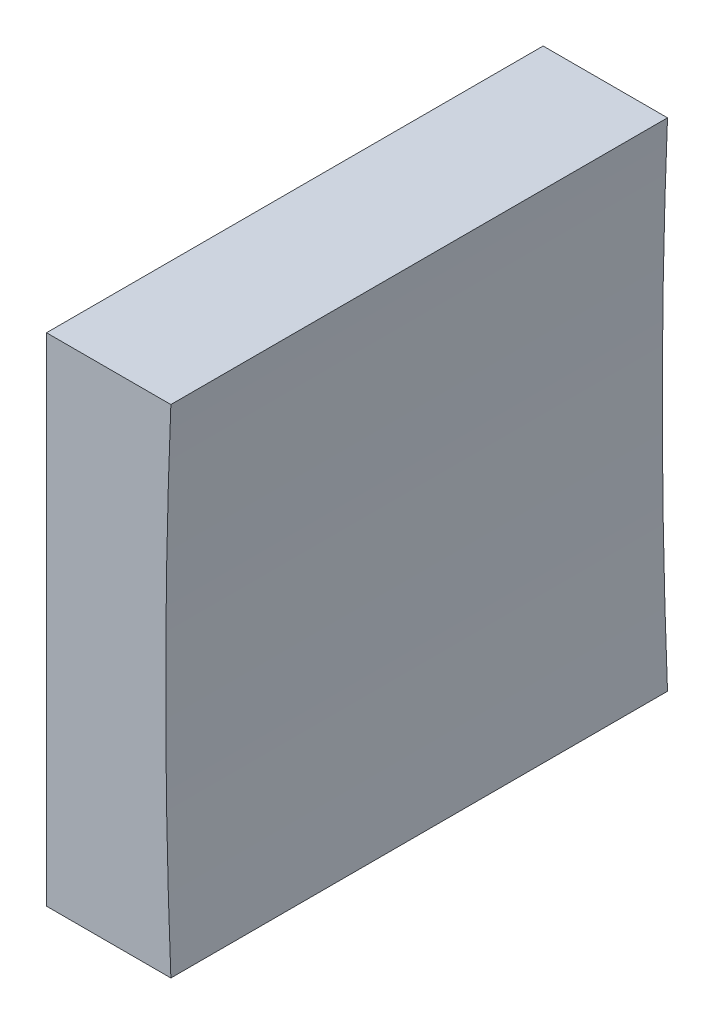
ISO-10303-21;
HEADER;
FILE_DESCRIPTION(('STEP AP214'),'2;1');
FILE_NAME('part.step','',(''),(''),'','','');
FILE_SCHEMA(('AUTOMOTIVE_DESIGN { 1 0 10303 214 1 1 1 1 }'));
ENDSEC;
DATA;
#1=APPLICATION_CONTEXT('core data for automotive mechanical design processes');
#2=APPLICATION_PROTOCOL_DEFINITION('international standard','automotive_design',2000,#1);
#3=PRODUCT_CONTEXT('',#1,'mechanical');
#4=PRODUCT('Part','Part','',(#3));
#5=PRODUCT_RELATED_PRODUCT_CATEGORY('part','',(#4));
#6=PRODUCT_DEFINITION_FORMATION('','',#4);
#7=PRODUCT_DEFINITION_CONTEXT('part definition',#1,'design');
#8=PRODUCT_DEFINITION('design','',#6,#7);
#9=PRODUCT_DEFINITION_SHAPE('','',#8);
#10=(LENGTH_UNIT() NAMED_UNIT(*) SI_UNIT(.MILLI.,.METRE.));
#11=(NAMED_UNIT(*) PLANE_ANGLE_UNIT() SI_UNIT($,.RADIAN.));
#12=(NAMED_UNIT(*) SI_UNIT($,.STERADIAN.) SOLID_ANGLE_UNIT());
#13=UNCERTAINTY_MEASURE_WITH_UNIT(LENGTH_MEASURE(1.E-05),#10,'distance_accuracy_value','');
#14=(GEOMETRIC_REPRESENTATION_CONTEXT(3) GLOBAL_UNCERTAINTY_ASSIGNED_CONTEXT((#13)) GLOBAL_UNIT_ASSIGNED_CONTEXT((#10,
#11,#12)) REPRESENTATION_CONTEXT('',''));
#15=CARTESIAN_POINT('',(0.,0.,0.));
#16=DIRECTION('',(0.,0.,1.));
#17=DIRECTION('',(1.,0.,0.));
#18=AXIS2_PLACEMENT_3D('',#15,#16,#17);
#19=CARTESIAN_POINT('',(290.967665424244,54.3579292677671,25.));
#20=DIRECTION('',(0.,1.,0.));
#21=DIRECTION('',(-1.,0.,0.));
#22=AXIS2_PLACEMENT_3D('',#19,#20,#21);
#23=PLANE('',#22);
#24=DIRECTION('',(1.,0.,0.));
#25=VECTOR('',#24,1.);
#26=CARTESIAN_POINT('',(290.967665424244,54.3579292677671,0.));
#27=LINE('',#26,#25);
#28=CARTESIAN_POINT('',(284.707135631282,54.3579292677671,0.));
#29=VERTEX_POINT('',#28);
#30=CARTESIAN_POINT('',(290.967665424244,54.3579292677671,0.));
#31=VERTEX_POINT('',#30);
#32=EDGE_CURVE('E91',#29,#31,#27,.T.);
#33=ORIENTED_EDGE('',*,*,#32,.T.);
#34=DIRECTION('',(0.,0.,-1.));
#35=VECTOR('',#34,1.);
#36=CARTESIAN_POINT('',(290.967665424244,54.3579292677671,25.));
#37=LINE('',#36,#35);
#38=CARTESIAN_POINT('',(290.967665424244,54.3579292677671,25.));
#39=VERTEX_POINT('',#38);
#40=EDGE_CURVE('E45',#39,#31,#37,.T.);
#41=ORIENTED_EDGE('',*,*,#40,.F.);
#42=DIRECTION('',(1.,0.,0.));
#43=VECTOR('',#42,1.);
#44=CARTESIAN_POINT('',(290.967665424244,54.3579292677671,25.));
#45=LINE('',#44,#43);
#46=CARTESIAN_POINT('',(284.707135631282,54.3579292677671,25.));
#47=VERTEX_POINT('',#46);
#48=EDGE_CURVE('E84',#47,#39,#45,.T.);
#49=ORIENTED_EDGE('',*,*,#48,.F.);
#50=DIRECTION('',(0.,0.,-1.));
#51=VECTOR('',#50,1.);
#52=CARTESIAN_POINT('',(284.707135631282,54.3579292677671,25.));
#53=LINE('',#52,#51);
#54=EDGE_CURVE('E11',#47,#29,#53,.T.);
#55=ORIENTED_EDGE('',*,*,#54,.T.);
#56=EDGE_LOOP('',(#33,#41,#49,#55));
#57=FACE_BOUND('',#56,.T.);
#58=ADVANCED_FACE('F37',(#57),#23,.F.);
#59=CARTESIAN_POINT('',(590.707135631289,66.8579292677671,25.));
#60=DIRECTION('',(0.,0.,-1.));
#61=DIRECTION('',(-1.,0.,0.));
#62=AXIS2_PLACEMENT_3D('',#59,#60,#61);
#63=CYLINDRICAL_SURFACE('',#62,300.);
#64=CARTESIAN_POINT('',(590.707135631289,66.8579292677671,0.));
#65=DIRECTION('',(0.,0.,-1.));
#66=DIRECTION('',(1.,0.,0.));
#67=AXIS2_PLACEMENT_3D('',#64,#65,#66);
#68=CIRCLE('',#67,300.);
#69=CARTESIAN_POINT('',(290.967665424244,79.3579292677671,0.));
#70=VERTEX_POINT('',#69);
#71=EDGE_CURVE('E71',#31,#70,#68,.T.);
#72=ORIENTED_EDGE('',*,*,#71,.T.);
#73=DIRECTION('',(0.,0.,-1.));
#74=VECTOR('',#73,1.);
#75=CARTESIAN_POINT('',(290.967665424244,79.3579292677671,25.));
#76=LINE('',#75,#74);
#77=CARTESIAN_POINT('',(290.967665424244,79.3579292677671,25.));
#78=VERTEX_POINT('',#77);
#79=EDGE_CURVE('E92',#78,#70,#76,.T.);
#80=ORIENTED_EDGE('',*,*,#79,.F.);
#81=CARTESIAN_POINT('',(590.707135631289,66.8579292677671,25.));
#82=DIRECTION('',(0.,0.,-1.));
#83=DIRECTION('',(1.,0.,0.));
#84=AXIS2_PLACEMENT_3D('',#81,#82,#83);
#85=CIRCLE('',#84,300.);
#86=EDGE_CURVE('E88',#39,#78,#85,.T.);
#87=ORIENTED_EDGE('',*,*,#86,.F.);
#88=ORIENTED_EDGE('',*,*,#40,.T.);
#89=EDGE_LOOP('',(#72,#80,#87,#88));
#90=FACE_BOUND('',#89,.T.);
#91=ADVANCED_FACE('F93',(#90),#63,.F.);
#92=CARTESIAN_POINT('',(284.707135631282,79.3579292677671,25.));
#93=DIRECTION('',(0.,-1.,0.));
#94=DIRECTION('',(0.,0.,-1.));
#95=AXIS2_PLACEMENT_3D('',#92,#93,#94);
#96=PLANE('',#95);
#97=DIRECTION('',(-1.,0.,0.));
#98=VECTOR('',#97,1.);
#99=CARTESIAN_POINT('',(284.707135631282,79.3579292677671,0.));
#100=LINE('',#99,#98);
#101=CARTESIAN_POINT('',(284.707135631282,79.3579292677671,0.));
#102=VERTEX_POINT('',#101);
#103=EDGE_CURVE('E78',#70,#102,#100,.T.);
#104=ORIENTED_EDGE('',*,*,#103,.T.);
#105=DIRECTION('',(0.,0.,-1.));
#106=VECTOR('',#105,1.);
#107=CARTESIAN_POINT('',(284.707135631282,79.3579292677671,25.));
#108=LINE('',#107,#106);
#109=CARTESIAN_POINT('',(284.707135631282,79.3579292677671,25.));
#110=VERTEX_POINT('',#109);
#111=EDGE_CURVE('E97',#110,#102,#108,.T.);
#112=ORIENTED_EDGE('',*,*,#111,.F.);
#113=DIRECTION('',(-1.,0.,0.));
#114=VECTOR('',#113,1.);
#115=CARTESIAN_POINT('',(284.707135631282,79.3579292677671,25.));
#116=LINE('',#115,#114);
#117=EDGE_CURVE('E95',#78,#110,#116,.T.);
#118=ORIENTED_EDGE('',*,*,#117,.F.);
#119=ORIENTED_EDGE('',*,*,#79,.T.);
#120=EDGE_LOOP('',(#104,#112,#118,#119));
#121=FACE_BOUND('',#120,.T.);
#122=ADVANCED_FACE('F107',(#121),#96,.F.);
#123=CARTESIAN_POINT('',(284.707135631282,66.8579292677671,25.));
#124=DIRECTION('',(1.,0.,0.));
#125=DIRECTION('',(0.,0.,-1.));
#126=AXIS2_PLACEMENT_3D('',#123,#124,#125);
#127=PLANE('',#126);
#128=DIRECTION('',(0.,-1.,0.));
#129=VECTOR('',#128,1.);
#130=CARTESIAN_POINT('',(284.707135631282,66.8579292677671,0.));
#131=LINE('',#130,#129);
#132=EDGE_CURVE('E104',#102,#29,#131,.T.);
#133=ORIENTED_EDGE('',*,*,#132,.T.);
#134=ORIENTED_EDGE('',*,*,#54,.F.);
#135=DIRECTION('',(0.,-1.,0.));
#136=VECTOR('',#135,1.);
#137=CARTESIAN_POINT('',(284.707135631282,54.3579292677671,25.));
#138=LINE('',#137,#136);
#139=EDGE_CURVE('E53',#110,#47,#138,.T.);
#140=ORIENTED_EDGE('',*,*,#139,.F.);
#141=ORIENTED_EDGE('',*,*,#111,.T.);
#142=EDGE_LOOP('',(#133,#134,#140,#141));
#143=FACE_BOUND('',#142,.T.);
#144=ADVANCED_FACE('F111',(#143),#127,.F.);
#145=CARTESIAN_POINT('',(590.707135631289,66.8579292677671,25.));
#146=DIRECTION('',(0.,0.,1.));
#147=DIRECTION('',(1.,0.,0.));
#148=AXIS2_PLACEMENT_3D('',#145,#146,#147);
#149=PLANE('',#148);
#150=ORIENTED_EDGE('',*,*,#139,.T.);
#151=ORIENTED_EDGE('',*,*,#48,.T.);
#152=ORIENTED_EDGE('',*,*,#86,.T.);
#153=ORIENTED_EDGE('',*,*,#117,.T.);
#154=EDGE_LOOP('',(#150,#151,#152,#153));
#155=FACE_BOUND('',#154,.T.);
#156=ADVANCED_FACE('F86',(#155),#149,.T.);
#157=CARTESIAN_POINT('',(590.707135631289,66.8579292677671,0.));
#158=DIRECTION('',(0.,0.,1.));
#159=DIRECTION('',(1.,0.,0.));
#160=AXIS2_PLACEMENT_3D('',#157,#158,#159);
#161=PLANE('',#160);
#162=ORIENTED_EDGE('',*,*,#32,.F.);
#163=ORIENTED_EDGE('',*,*,#132,.F.);
#164=ORIENTED_EDGE('',*,*,#103,.F.);
#165=ORIENTED_EDGE('',*,*,#71,.F.);
#166=EDGE_LOOP('',(#162,#163,#164,#165));
#167=FACE_BOUND('',#166,.T.);
#168=ADVANCED_FACE('F110',(#167),#161,.F.);
#169=CLOSED_SHELL('',(#58,#91,#122,#144,#156,#168));
#170=MANIFOLD_SOLID_BREP('B2',#169);
#171=ADVANCED_BREP_SHAPE_REPRESENTATION('',(#18,#170),#14);
#172=SHAPE_DEFINITION_REPRESENTATION(#9,#171);
ENDSEC;
END-ISO-10303-21;
